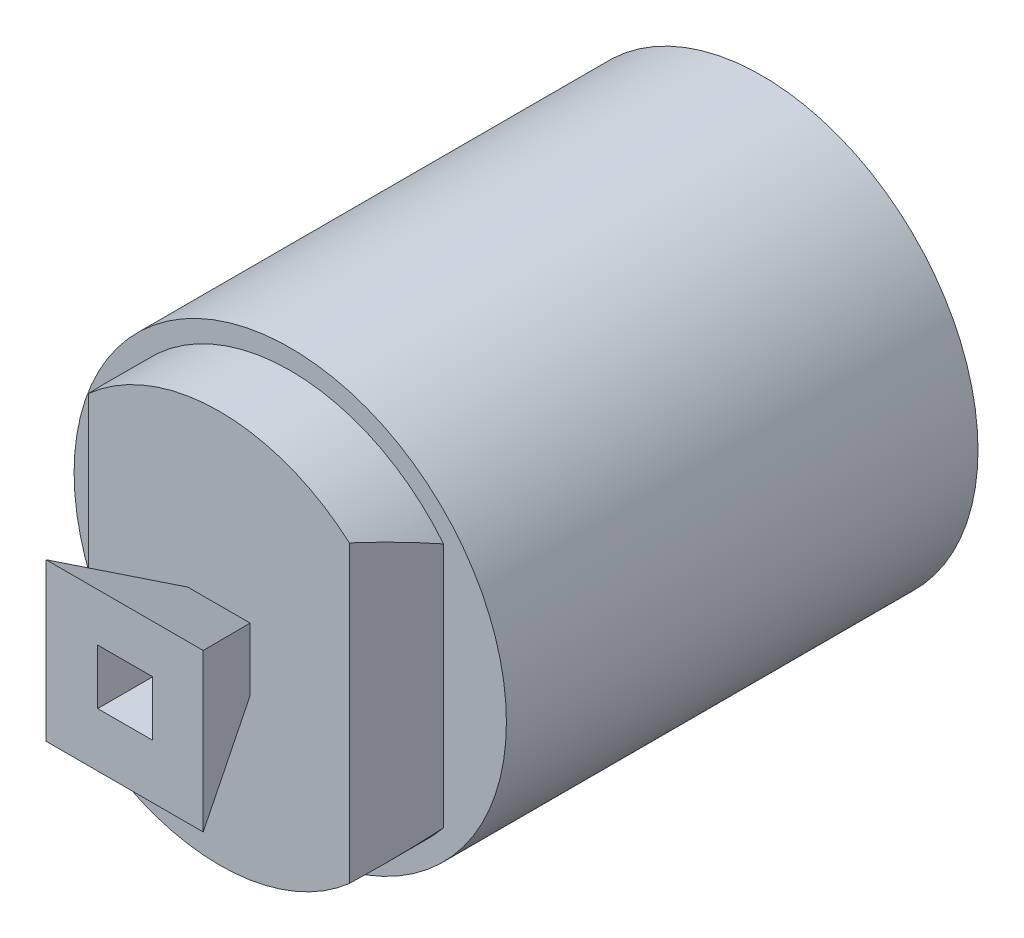
ISO-10303-21;
HEADER;
FILE_DESCRIPTION(('STEP AP214'),'2;1');
FILE_NAME('part.step','',(''),(''),'','','');
FILE_SCHEMA(('AUTOMOTIVE_DESIGN { 1 0 10303 214 1 1 1 1 }'));
ENDSEC;
DATA;
#1=APPLICATION_CONTEXT('core data for automotive mechanical design processes');
#2=APPLICATION_PROTOCOL_DEFINITION('international standard','automotive_design',2000,#1);
#3=PRODUCT_CONTEXT('',#1,'mechanical');
#4=PRODUCT('Part','Part','',(#3));
#5=PRODUCT_RELATED_PRODUCT_CATEGORY('part','',(#4));
#6=PRODUCT_DEFINITION_FORMATION('','',#4);
#7=PRODUCT_DEFINITION_CONTEXT('part definition',#1,'design');
#8=PRODUCT_DEFINITION('design','',#6,#7);
#9=PRODUCT_DEFINITION_SHAPE('','',#8);
#10=(LENGTH_UNIT() NAMED_UNIT(*) SI_UNIT(.MILLI.,.METRE.));
#11=(NAMED_UNIT(*) PLANE_ANGLE_UNIT() SI_UNIT($,.RADIAN.));
#12=(NAMED_UNIT(*) SI_UNIT($,.STERADIAN.) SOLID_ANGLE_UNIT());
#13=UNCERTAINTY_MEASURE_WITH_UNIT(LENGTH_MEASURE(1.E-05),#10,'distance_accuracy_value','');
#14=(GEOMETRIC_REPRESENTATION_CONTEXT(3) GLOBAL_UNCERTAINTY_ASSIGNED_CONTEXT((#13)) GLOBAL_UNIT_ASSIGNED_CONTEXT((#10,
#11,#12)) REPRESENTATION_CONTEXT('',''));
#15=CARTESIAN_POINT('',(0.,0.,0.));
#16=DIRECTION('',(0.,0.,1.));
#17=DIRECTION('',(1.,0.,0.));
#18=AXIS2_PLACEMENT_3D('',#15,#16,#17);
#19=CARTESIAN_POINT('',(-10.0761007393835,-20.,81.));
#20=DIRECTION('',(0.,0.,1.));
#21=DIRECTION('',(1.,0.,0.));
#22=AXIS2_PLACEMENT_3D('',#19,#20,#21);
#23=PLANE('',#22);
#24=DIRECTION('',(0.,1.,0.));
#25=VECTOR('',#24,1.);
#26=CARTESIAN_POINT('',(-10.0761007393835,-20.,81.));
#27=LINE('',#26,#25);
#28=CARTESIAN_POINT('',(-10.0761007393835,-10.386236585579,81.));
#29=VERTEX_POINT('',#28);
#30=CARTESIAN_POINT('',(-10.0761007393835,9.613763414421,81.));
#31=VERTEX_POINT('',#30);
#32=EDGE_CURVE('E281',#29,#31,#27,.T.);
#33=ORIENTED_EDGE('',*,*,#32,.F.);
#34=DIRECTION('',(-1.,0.,0.));
#35=VECTOR('',#34,1.);
#36=CARTESIAN_POINT('',(30.,-10.386236585579,81.));
#37=LINE('',#36,#35);
#38=CARTESIAN_POINT('',(9.92389926061654,-10.386236585579,81.));
#39=VERTEX_POINT('',#38);
#40=EDGE_CURVE('E261',#39,#29,#37,.T.);
#41=ORIENTED_EDGE('',*,*,#40,.F.);
#42=DIRECTION('',(0.,1.,0.));
#43=VECTOR('',#42,1.);
#44=CARTESIAN_POINT('',(9.92389926061654,-20.,81.));
#45=LINE('',#44,#43);
#46=CARTESIAN_POINT('',(9.92389926061654,9.613763414421,81.));
#47=VERTEX_POINT('',#46);
#48=EDGE_CURVE('E277',#39,#47,#45,.T.);
#49=ORIENTED_EDGE('',*,*,#48,.T.);
#50=DIRECTION('',(-1.,0.,0.));
#51=VECTOR('',#50,1.);
#52=CARTESIAN_POINT('',(30.,9.613763414421,81.));
#53=LINE('',#52,#51);
#54=EDGE_CURVE('E264',#47,#31,#53,.T.);
#55=ORIENTED_EDGE('',*,*,#54,.T.);
#56=EDGE_LOOP('',(#33,#41,#49,#55));
#57=FACE_BOUND('',#56,.T.);
#58=DIRECTION('',(1.,0.,0.));
#59=VECTOR('',#58,1.);
#60=CARTESIAN_POINT('',(-10.0761007393835,3.5,81.));
#61=LINE('',#60,#59);
#62=CARTESIAN_POINT('',(-3.5,3.5,81.));
#63=VERTEX_POINT('',#62);
#64=CARTESIAN_POINT('',(3.5,3.5,81.));
#65=VERTEX_POINT('',#64);
#66=EDGE_CURVE('E196',#63,#65,#61,.T.);
#67=ORIENTED_EDGE('',*,*,#66,.T.);
#68=DIRECTION('',(0.,-1.,0.));
#69=VECTOR('',#68,1.);
#70=CARTESIAN_POINT('',(3.5,-20.,81.));
#71=LINE('',#70,#69);
#72=CARTESIAN_POINT('',(3.5,-3.5,81.));
#73=VERTEX_POINT('',#72);
#74=EDGE_CURVE('E191',#65,#73,#71,.T.);
#75=ORIENTED_EDGE('',*,*,#74,.T.);
#76=DIRECTION('',(-1.,0.,0.));
#77=VECTOR('',#76,1.);
#78=CARTESIAN_POINT('',(-10.0761007393835,-3.5,81.));
#79=LINE('',#78,#77);
#80=CARTESIAN_POINT('',(-3.5,-3.5,81.));
#81=VERTEX_POINT('',#80);
#82=EDGE_CURVE('E180',#73,#81,#79,.T.);
#83=ORIENTED_EDGE('',*,*,#82,.T.);
#84=DIRECTION('',(0.,1.,0.));
#85=VECTOR('',#84,1.);
#86=CARTESIAN_POINT('',(-3.5,-20.,81.));
#87=LINE('',#86,#85);
#88=EDGE_CURVE('E185',#81,#63,#87,.T.);
#89=ORIENTED_EDGE('',*,*,#88,.T.);
#90=EDGE_LOOP('',(#67,#75,#83,#89));
#91=FACE_BOUND('',#90,.T.);
#92=ADVANCED_FACE('F34',(#57,#91),#23,.T.);
#93=CARTESIAN_POINT('',(0.,0.,68.));
#94=DIRECTION('',(0.,0.,-1.));
#95=DIRECTION('',(-1.,0.,0.));
#96=AXIS2_PLACEMENT_3D('',#93,#94,#95);
#97=PLANE('',#96);
#98=DIRECTION('',(0.,-1.,0.));
#99=VECTOR('',#98,1.);
#100=CARTESIAN_POINT('',(-16.,18.,68.));
#101=LINE('',#100,#99);
#102=CARTESIAN_POINT('',(-16.,18.,68.));
#103=VERTEX_POINT('',#102);
#104=CARTESIAN_POINT('',(-16.,-18.,68.));
#105=VERTEX_POINT('',#104);
#106=EDGE_CURVE('E239',#103,#105,#101,.T.);
#107=ORIENTED_EDGE('',*,*,#106,.F.);
#108=DIRECTION('',(-1.,0.,0.));
#109=VECTOR('',#108,1.);
#110=CARTESIAN_POINT('',(16.,18.,68.));
#111=LINE('',#110,#109);
#112=CARTESIAN_POINT('',(16.,18.,68.));
#113=VERTEX_POINT('',#112);
#114=EDGE_CURVE('E246',#113,#103,#111,.T.);
#115=ORIENTED_EDGE('',*,*,#114,.F.);
#116=DIRECTION('',(0.,1.,0.));
#117=VECTOR('',#116,1.);
#118=CARTESIAN_POINT('',(16.,18.,68.));
#119=LINE('',#118,#117);
#120=CARTESIAN_POINT('',(16.,-18.,68.));
#121=VERTEX_POINT('',#120);
#122=EDGE_CURVE('E244',#121,#113,#119,.T.);
#123=ORIENTED_EDGE('',*,*,#122,.F.);
#124=DIRECTION('',(1.,0.,0.));
#125=VECTOR('',#124,1.);
#126=CARTESIAN_POINT('',(16.,-18.,68.));
#127=LINE('',#126,#125);
#128=EDGE_CURVE('E242',#105,#121,#127,.T.);
#129=ORIENTED_EDGE('',*,*,#128,.F.);
#130=EDGE_LOOP('',(#107,#115,#123,#129));
#131=FACE_BOUND('',#130,.T.);
#132=DIRECTION('',(1.,0.,0.));
#133=VECTOR('',#132,1.);
#134=CARTESIAN_POINT('',(0.,-3.5,68.));
#135=LINE('',#134,#133);
#136=CARTESIAN_POINT('',(-3.5,-3.5,68.));
#137=VERTEX_POINT('',#136);
#138=CARTESIAN_POINT('',(3.5,-3.5,68.));
#139=VERTEX_POINT('',#138);
#140=EDGE_CURVE('E340',#137,#139,#135,.T.);
#141=ORIENTED_EDGE('',*,*,#140,.T.);
#142=DIRECTION('',(0.,1.,0.));
#143=VECTOR('',#142,1.);
#144=CARTESIAN_POINT('',(3.5,0.,68.));
#145=LINE('',#144,#143);
#146=CARTESIAN_POINT('',(3.5,3.5,68.));
#147=VERTEX_POINT('',#146);
#148=EDGE_CURVE('E11',#139,#147,#145,.T.);
#149=ORIENTED_EDGE('',*,*,#148,.T.);
#150=DIRECTION('',(-1.,0.,0.));
#151=VECTOR('',#150,1.);
#152=CARTESIAN_POINT('',(0.,3.5,68.));
#153=LINE('',#152,#151);
#154=CARTESIAN_POINT('',(-3.5,3.5,68.));
#155=VERTEX_POINT('',#154);
#156=EDGE_CURVE('E42',#147,#155,#153,.T.);
#157=ORIENTED_EDGE('',*,*,#156,.T.);
#158=DIRECTION('',(0.,-1.,0.));
#159=VECTOR('',#158,1.);
#160=CARTESIAN_POINT('',(-3.5,0.,68.));
#161=LINE('',#160,#159);
#162=EDGE_CURVE('E342',#155,#137,#161,.T.);
#163=ORIENTED_EDGE('',*,*,#162,.T.);
#164=EDGE_LOOP('',(#141,#149,#157,#163));
#165=FACE_BOUND('',#164,.T.);
#166=ADVANCED_FACE('F346',(#131,#165),#97,.T.);
#167=CARTESIAN_POINT('',(0.,0.,59.));
#168=DIRECTION('',(0.,0.,1.));
#169=DIRECTION('',(1.,0.,0.));
#170=AXIS2_PLACEMENT_3D('',#167,#168,#169);
#171=PLANE('',#170);
#172=CARTESIAN_POINT('',(0.,0.,59.));
#173=DIRECTION('',(0.,0.,1.));
#174=DIRECTION('',(1.,0.,0.));
#175=AXIS2_PLACEMENT_3D('',#172,#173,#174);
#176=CIRCLE('',#175,27.);
#177=CARTESIAN_POINT('',(27.,0.,59.));
#178=VERTEX_POINT('',#177);
#179=EDGE_CURVE('E306',#178,#178,#176,.T.);
#180=ORIENTED_EDGE('',*,*,#179,.F.);
#181=EDGE_LOOP('',(#180));
#182=FACE_BOUND('',#181,.T.);
#183=DIRECTION('',(1.,0.,0.));
#184=VECTOR('',#183,1.);
#185=CARTESIAN_POINT('',(0.,15.,59.));
#186=LINE('',#185,#184);
#187=CARTESIAN_POINT('',(-19.0078041691542,15.,59.));
#188=VERTEX_POINT('',#187);
#189=CARTESIAN_POINT('',(-16.,15.,59.));
#190=VERTEX_POINT('',#189);
#191=EDGE_CURVE('E226',#188,#190,#186,.T.);
#192=ORIENTED_EDGE('',*,*,#191,.F.);
#193=DIRECTION('',(0.,1.,0.));
#194=VECTOR('',#193,1.);
#195=CARTESIAN_POINT('',(-19.0078041691542,0.,59.));
#196=LINE('',#195,#194);
#197=CARTESIAN_POINT('',(-19.0078041691542,-15.,59.));
#198=VERTEX_POINT('',#197);
#199=EDGE_CURVE('E232',#198,#188,#196,.T.);
#200=ORIENTED_EDGE('',*,*,#199,.F.);
#201=DIRECTION('',(1.,0.,0.));
#202=VECTOR('',#201,1.);
#203=CARTESIAN_POINT('',(0.,-15.,59.));
#204=LINE('',#203,#202);
#205=CARTESIAN_POINT('',(-16.,-15.,59.));
#206=VERTEX_POINT('',#205);
#207=EDGE_CURVE('E218',#198,#206,#204,.T.);
#208=ORIENTED_EDGE('',*,*,#207,.T.);
#209=DIRECTION('',(0.,1.,0.));
#210=VECTOR('',#209,1.);
#211=CARTESIAN_POINT('',(-16.,0.,59.));
#212=LINE('',#211,#210);
#213=CARTESIAN_POINT('',(-16.,-18.,59.));
#214=VERTEX_POINT('',#213);
#215=EDGE_CURVE('E337',#214,#206,#212,.T.);
#216=ORIENTED_EDGE('',*,*,#215,.F.);
#217=DIRECTION('',(-1.,0.,0.));
#218=VECTOR('',#217,1.);
#219=CARTESIAN_POINT('',(0.,-18.,59.));
#220=LINE('',#219,#218);
#221=CARTESIAN_POINT('',(16.,-18.,59.));
#222=VERTEX_POINT('',#221);
#223=EDGE_CURVE('E334',#222,#214,#220,.T.);
#224=ORIENTED_EDGE('',*,*,#223,.F.);
#225=DIRECTION('',(0.,-1.,0.));
#226=VECTOR('',#225,1.);
#227=CARTESIAN_POINT('',(16.,0.,59.));
#228=LINE('',#227,#226);
#229=CARTESIAN_POINT('',(16.,-15.,59.));
#230=VERTEX_POINT('',#229);
#231=EDGE_CURVE('E330',#230,#222,#228,.T.);
#232=ORIENTED_EDGE('',*,*,#231,.F.);
#233=CARTESIAN_POINT('',(18.8315879003216,-15.,59.));
#234=VERTEX_POINT('',#233);
#235=EDGE_CURVE('E214',#230,#234,#204,.T.);
#236=ORIENTED_EDGE('',*,*,#235,.T.);
#237=DIRECTION('',(0.,-1.,0.));
#238=VECTOR('',#237,1.);
#239=CARTESIAN_POINT('',(18.8315879003216,0.,59.));
#240=LINE('',#239,#238);
#241=CARTESIAN_POINT('',(18.8315879003216,15.,59.));
#242=VERTEX_POINT('',#241);
#243=EDGE_CURVE('E237',#242,#234,#240,.T.);
#244=ORIENTED_EDGE('',*,*,#243,.F.);
#245=CARTESIAN_POINT('',(16.,15.,59.));
#246=VERTEX_POINT('',#245);
#247=EDGE_CURVE('E223',#246,#242,#186,.T.);
#248=ORIENTED_EDGE('',*,*,#247,.F.);
#249=CARTESIAN_POINT('',(16.,18.,59.));
#250=VERTEX_POINT('',#249);
#251=EDGE_CURVE('E331',#250,#246,#228,.T.);
#252=ORIENTED_EDGE('',*,*,#251,.F.);
#253=DIRECTION('',(1.,0.,0.));
#254=VECTOR('',#253,1.);
#255=CARTESIAN_POINT('',(0.,18.,59.));
#256=LINE('',#255,#254);
#257=CARTESIAN_POINT('',(-16.,18.,59.));
#258=VERTEX_POINT('',#257);
#259=EDGE_CURVE('E328',#258,#250,#256,.T.);
#260=ORIENTED_EDGE('',*,*,#259,.F.);
#261=EDGE_CURVE('E336',#190,#258,#212,.T.);
#262=ORIENTED_EDGE('',*,*,#261,.F.);
#263=EDGE_LOOP('',(#192,#200,#208,#216,#224,#232,#236,#244,#248,#252,#260,#262));
#264=FACE_BOUND('',#263,.T.);
#265=ADVANCED_FACE('F372',(#182,#264),#171,.F.);
#266=CARTESIAN_POINT('',(-16.,18.,68.));
#267=DIRECTION('',(1.,0.,0.));
#268=DIRECTION('',(0.,1.,0.));
#269=AXIS2_PLACEMENT_3D('',#266,#267,#268);
#270=PLANE('',#269);
#271=DIRECTION('',(0.,1.,0.));
#272=VECTOR('',#271,1.);
#273=CARTESIAN_POINT('',(-16.,18.,67.8492471136705));
#274=LINE('',#273,#272);
#275=CARTESIAN_POINT('',(-16.,-15.,67.8492471136705));
#276=VERTEX_POINT('',#275);
#277=CARTESIAN_POINT('',(-16.,15.,67.8492471136705));
#278=VERTEX_POINT('',#277);
#279=EDGE_CURVE('E229',#276,#278,#274,.T.);
#280=ORIENTED_EDGE('',*,*,#279,.T.);
#281=DIRECTION('',(0.,0.,-1.));
#282=VECTOR('',#281,1.);
#283=CARTESIAN_POINT('',(-16.,15.,68.));
#284=LINE('',#283,#282);
#285=EDGE_CURVE('E225',#278,#190,#284,.T.);
#286=ORIENTED_EDGE('',*,*,#285,.T.);
#287=ORIENTED_EDGE('',*,*,#261,.T.);
#288=DIRECTION('',(0.,0.,-1.));
#289=VECTOR('',#288,1.);
#290=CARTESIAN_POINT('',(-16.,18.,68.));
#291=LINE('',#290,#289);
#292=EDGE_CURVE('E248',#103,#258,#291,.T.);
#293=ORIENTED_EDGE('',*,*,#292,.F.);
#294=ORIENTED_EDGE('',*,*,#106,.T.);
#295=DIRECTION('',(0.,0.,-1.));
#296=VECTOR('',#295,1.);
#297=CARTESIAN_POINT('',(-16.,-18.,68.));
#298=LINE('',#297,#296);
#299=EDGE_CURVE('E257',#105,#214,#298,.T.);
#300=ORIENTED_EDGE('',*,*,#299,.T.);
#301=ORIENTED_EDGE('',*,*,#215,.T.);
#302=DIRECTION('',(0.,0.,-1.));
#303=VECTOR('',#302,1.);
#304=CARTESIAN_POINT('',(-16.,-15.,68.));
#305=LINE('',#304,#303);
#306=EDGE_CURVE('E217',#276,#206,#305,.T.);
#307=ORIENTED_EDGE('',*,*,#306,.F.);
#308=EDGE_LOOP('',(#280,#286,#287,#293,#294,#300,#301,#307));
#309=FACE_BOUND('',#308,.T.);
#310=ADVANCED_FACE('F409',(#309),#270,.T.);
#311=CARTESIAN_POINT('',(16.,18.,68.));
#312=DIRECTION('',(-1.,0.,0.));
#313=DIRECTION('',(0.,-1.,0.));
#314=AXIS2_PLACEMENT_3D('',#311,#312,#313);
#315=PLANE('',#314);
#316=ORIENTED_EDGE('',*,*,#251,.T.);
#317=DIRECTION('',(0.,0.,1.));
#318=VECTOR('',#317,1.);
#319=CARTESIAN_POINT('',(16.,15.,68.));
#320=LINE('',#319,#318);
#321=CARTESIAN_POINT('',(16.,15.,67.5394789664373));
#322=VERTEX_POINT('',#321);
#323=EDGE_CURVE('E220',#246,#322,#320,.T.);
#324=ORIENTED_EDGE('',*,*,#323,.T.);
#325=DIRECTION('',(0.,-1.,0.));
#326=VECTOR('',#325,1.);
#327=CARTESIAN_POINT('',(16.,18.,67.5394789664373));
#328=LINE('',#327,#326);
#329=CARTESIAN_POINT('',(16.,-15.,67.5394789664373));
#330=VERTEX_POINT('',#329);
#331=EDGE_CURVE('E234',#322,#330,#328,.T.);
#332=ORIENTED_EDGE('',*,*,#331,.T.);
#333=DIRECTION('',(0.,0.,1.));
#334=VECTOR('',#333,1.);
#335=CARTESIAN_POINT('',(16.,-15.,68.));
#336=LINE('',#335,#334);
#337=EDGE_CURVE('E212',#230,#330,#336,.T.);
#338=ORIENTED_EDGE('',*,*,#337,.F.);
#339=ORIENTED_EDGE('',*,*,#231,.T.);
#340=DIRECTION('',(0.,0.,-1.));
#341=VECTOR('',#340,1.);
#342=CARTESIAN_POINT('',(16.,-18.,68.));
#343=LINE('',#342,#341);
#344=EDGE_CURVE('E254',#121,#222,#343,.T.);
#345=ORIENTED_EDGE('',*,*,#344,.F.);
#346=ORIENTED_EDGE('',*,*,#122,.T.);
#347=DIRECTION('',(0.,0.,-1.));
#348=VECTOR('',#347,1.);
#349=CARTESIAN_POINT('',(16.,18.,68.));
#350=LINE('',#349,#348);
#351=EDGE_CURVE('E251',#113,#250,#350,.T.);
#352=ORIENTED_EDGE('',*,*,#351,.T.);
#353=EDGE_LOOP('',(#316,#324,#332,#338,#339,#345,#346,#352));
#354=FACE_BOUND('',#353,.T.);
#355=ADVANCED_FACE('F388',(#354),#315,.T.);
#356=CARTESIAN_POINT('',(9.92389926061654,-20.,81.));
#357=DIRECTION('',(0.893452439046446,0.,-0.44915781097734));
#358=DIRECTION('',(-0.44915781097734,0.,-0.893452439046446));
#359=AXIS2_PLACEMENT_3D('',#356,#357,#358);
#360=PLANE('',#359);
#361=ORIENTED_EDGE('',*,*,#48,.F.);
#362=DIRECTION('',(-0.410097562207873,0.407877429988755,-0.815754859977511));
#363=VECTOR('',#362,1.);
#364=CARTESIAN_POINT('',(11.5319890419045,-11.9856207020114,84.1987682328648));
#365=LINE('',#364,#363);
#366=CARTESIAN_POINT('',(3.89124044614115,-4.386236585579,69.));
#367=VERTEX_POINT('',#366);
#368=EDGE_CURVE('E273',#39,#367,#365,.T.);
#369=ORIENTED_EDGE('',*,*,#368,.T.);
#370=DIRECTION('',(0.,1.,0.));
#371=VECTOR('',#370,1.);
#372=CARTESIAN_POINT('',(3.89124044614115,-20.,69.));
#373=LINE('',#372,#371);
#374=CARTESIAN_POINT('',(3.89124044614115,3.613763414421,69.));
#375=VERTEX_POINT('',#374);
#376=EDGE_CURVE('E276',#367,#375,#373,.T.);
#377=ORIENTED_EDGE('',*,*,#376,.T.);
#378=DIRECTION('',(0.410097562207873,0.407877429988755,0.815754859977511));
#379=VECTOR('',#378,1.);
#380=CARTESIAN_POINT('',(4.97041868496857,4.68709934010398,71.146671851366));
#381=LINE('',#380,#379);
#382=EDGE_CURVE('E267',#375,#47,#381,.T.);
#383=ORIENTED_EDGE('',*,*,#382,.T.);
#384=EDGE_LOOP('',(#361,#369,#377,#383));
#385=FACE_BOUND('',#384,.T.);
#386=ADVANCED_FACE('F384',(#385),#360,.T.);
#387=CARTESIAN_POINT('',(-10.0761007393835,-20.,81.));
#388=DIRECTION('',(-0.893452439046446,0.,-0.44915781097734));
#389=DIRECTION('',(-0.44915781097734,0.,0.893452439046446));
#390=AXIS2_PLACEMENT_3D('',#387,#388,#389);
#391=PLANE('',#390);
#392=DIRECTION('',(0.,1.,0.));
#393=VECTOR('',#392,1.);
#394=CARTESIAN_POINT('',(-4.04344192490807,-20.,69.));
#395=LINE('',#394,#393);
#396=CARTESIAN_POINT('',(-4.04344192490807,-4.386236585579,69.));
#397=VERTEX_POINT('',#396);
#398=CARTESIAN_POINT('',(-4.04344192490807,3.613763414421,69.));
#399=VERTEX_POINT('',#398);
#400=EDGE_CURVE('E284',#397,#399,#395,.T.);
#401=ORIENTED_EDGE('',*,*,#400,.F.);
#402=DIRECTION('',(-0.410097562207872,-0.407877429988755,0.815754859977511));
#403=VECTOR('',#402,1.);
#404=CARTESIAN_POINT('',(-11.6841905206714,-11.9856207020114,84.1987682328648));
#405=LINE('',#404,#403);
#406=EDGE_CURVE('E325',#397,#29,#405,.T.);
#407=ORIENTED_EDGE('',*,*,#406,.T.);
#408=ORIENTED_EDGE('',*,*,#32,.T.);
#409=DIRECTION('',(0.410097562207872,-0.407877429988755,-0.815754859977511));
#410=VECTOR('',#409,1.);
#411=CARTESIAN_POINT('',(-5.12262016373549,4.68709934010398,71.146671851366));
#412=LINE('',#411,#410);
#413=EDGE_CURVE('E322',#31,#399,#412,.T.);
#414=ORIENTED_EDGE('',*,*,#413,.T.);
#415=EDGE_LOOP('',(#401,#407,#408,#414));
#416=FACE_BOUND('',#415,.T.);
#417=ADVANCED_FACE('F380',(#416),#391,.T.);
#418=CARTESIAN_POINT('',(0.,0.,69.));
#419=DIRECTION('',(0.,0.,1.));
#420=DIRECTION('',(1.,0.,0.));
#421=AXIS2_PLACEMENT_3D('',#418,#419,#420);
#422=PLANE('',#421);
#423=DIRECTION('',(-1.,0.,0.));
#424=VECTOR('',#423,1.);
#425=CARTESIAN_POINT('',(30.,-4.386236585579,69.));
#426=LINE('',#425,#424);
#427=EDGE_CURVE('E263',#367,#397,#426,.T.);
#428=ORIENTED_EDGE('',*,*,#427,.T.);
#429=ORIENTED_EDGE('',*,*,#400,.T.);
#430=DIRECTION('',(-1.,0.,0.));
#431=VECTOR('',#430,1.);
#432=CARTESIAN_POINT('',(30.,3.613763414421,69.));
#433=LINE('',#432,#431);
#434=EDGE_CURVE('E260',#375,#399,#433,.T.);
#435=ORIENTED_EDGE('',*,*,#434,.F.);
#436=ORIENTED_EDGE('',*,*,#376,.F.);
#437=EDGE_LOOP('',(#428,#429,#435,#436));
#438=FACE_BOUND('',#437,.T.);
#439=DIRECTION('',(0.,-1.,0.));
#440=VECTOR('',#439,1.);
#441=CARTESIAN_POINT('',(-16.6679103758723,0.,69.));
#442=LINE('',#441,#440);
#443=CARTESIAN_POINT('',(-16.6679103758723,18.632787330453,69.));
#444=VERTEX_POINT('',#443);
#445=CARTESIAN_POINT('',(-16.6679103758723,-18.632787330453,69.));
#446=VERTEX_POINT('',#445);
#447=EDGE_CURVE('E320',#444,#446,#442,.T.);
#448=ORIENTED_EDGE('',*,*,#447,.T.);
#449=CARTESIAN_POINT('',(0.,0.,69.));
#450=DIRECTION('',(0.,0.,1.));
#451=DIRECTION('',(1.,0.,0.));
#452=AXIS2_PLACEMENT_3D('',#449,#450,#451);
#453=CIRCLE('',#452,25.);
#454=CARTESIAN_POINT('',(16.5157088971054,-18.7678277812344,69.));
#455=VERTEX_POINT('',#454);
#456=EDGE_CURVE('E302',#446,#455,#453,.T.);
#457=ORIENTED_EDGE('',*,*,#456,.T.);
#458=DIRECTION('',(0.,1.,0.));
#459=VECTOR('',#458,1.);
#460=CARTESIAN_POINT('',(16.5157088971054,0.,69.));
#461=LINE('',#460,#459);
#462=CARTESIAN_POINT('',(16.5157088971054,18.7678277812344,69.));
#463=VERTEX_POINT('',#462);
#464=EDGE_CURVE('E313',#455,#463,#461,.T.);
#465=ORIENTED_EDGE('',*,*,#464,.T.);
#466=EDGE_CURVE('E299',#463,#444,#453,.T.);
#467=ORIENTED_EDGE('',*,*,#466,.T.);
#468=EDGE_LOOP('',(#448,#457,#465,#467));
#469=FACE_BOUND('',#468,.T.);
#470=ADVANCED_FACE('F383',(#438,#469),#422,.T.);
#471=CARTESIAN_POINT('',(0.,0.,69.));
#472=DIRECTION('',(0.,0.,-1.));
#473=DIRECTION('',(-1.,0.,0.));
#474=AXIS2_PLACEMENT_3D('',#471,#472,#473);
#475=CYLINDRICAL_SURFACE('',#474,25.);
#476=CARTESIAN_POINT('',(0.,0.,119.003731127617));
#477=DIRECTION('',(-0.948683298050514,0.,0.316227766016838));
#478=DIRECTION('',(-0.316227766016838,0.,-0.948683298050514));
#479=AXIS2_PLACEMENT_3D('',#476,#477,#478);
#480=ELLIPSE('',#479,79.0569415042095,25.);
#481=CARTESIAN_POINT('',(-19.6679103758723,-15.4328643305983,60.));
#482=VERTEX_POINT('',#481);
#483=EDGE_CURVE('E298',#482,#446,#480,.T.);
#484=ORIENTED_EDGE('',*,*,#483,.F.);
#485=CARTESIAN_POINT('',(0.,0.,60.));
#486=DIRECTION('',(0.,0.,1.));
#487=DIRECTION('',(1.,0.,0.));
#488=AXIS2_PLACEMENT_3D('',#485,#486,#487);
#489=CIRCLE('',#488,25.);
#490=CARTESIAN_POINT('',(19.5,-15.644487847162,60.));
#491=VERTEX_POINT('',#490);
#492=EDGE_CURVE('E303',#491,#482,#489,.F.);
#493=ORIENTED_EDGE('',*,*,#492,.F.);
#494=CARTESIAN_POINT('',(0.,0.,118.807935938211));
#495=DIRECTION('',(0.949179144879652,0.,0.314736319679717));
#496=DIRECTION('',(0.314736319679717,0.,-0.949179144879652));
#497=AXIS2_PLACEMENT_3D('',#494,#495,#496);
#498=ELLIPSE('',#497,79.4315699740041,25.);
#499=EDGE_CURVE('E291',#455,#491,#498,.T.);
#500=ORIENTED_EDGE('',*,*,#499,.F.);
#501=ORIENTED_EDGE('',*,*,#456,.F.);
#502=EDGE_LOOP('',(#484,#493,#500,#501));
#503=FACE_BOUND('',#502,.T.);
#504=ADVANCED_FACE('F401',(#503),#475,.T.);
#505=CARTESIAN_POINT('',(-19.6679103758723,15.4328643305983,60.));
#506=VERTEX_POINT('',#505);
#507=EDGE_CURVE('E296',#444,#506,#480,.T.);
#508=ORIENTED_EDGE('',*,*,#507,.F.);
#509=ORIENTED_EDGE('',*,*,#466,.F.);
#510=CARTESIAN_POINT('',(19.5,15.644487847162,60.));
#511=VERTEX_POINT('',#510);
#512=EDGE_CURVE('E295',#511,#463,#498,.T.);
#513=ORIENTED_EDGE('',*,*,#512,.F.);
#514=EDGE_CURVE('E301',#506,#511,#489,.F.);
#515=ORIENTED_EDGE('',*,*,#514,.F.);
#516=EDGE_LOOP('',(#508,#509,#513,#515));
#517=FACE_BOUND('',#516,.T.);
#518=ADVANCED_FACE('F405',(#517),#475,.T.);
#519=CARTESIAN_POINT('',(0.,0.,60.));
#520=DIRECTION('',(0.,0.,-1.));
#521=DIRECTION('',(-1.,0.,0.));
#522=AXIS2_PLACEMENT_3D('',#519,#520,#521);
#523=CYLINDRICAL_SURFACE('',#522,27.5);
#524=CARTESIAN_POINT('',(0.,0.,60.));
#525=DIRECTION('',(0.,0.,1.));
#526=DIRECTION('',(1.,0.,0.));
#527=AXIS2_PLACEMENT_3D('',#524,#525,#526);
#528=CIRCLE('',#527,27.5);
#529=CARTESIAN_POINT('',(27.5,0.,60.));
#530=VERTEX_POINT('',#529);
#531=EDGE_CURVE('E310',#530,#530,#528,.T.);
#532=ORIENTED_EDGE('',*,*,#531,.F.);
#533=EDGE_LOOP('',(#532));
#534=FACE_BOUND('',#533,.T.);
#535=CARTESIAN_POINT('',(0.,0.,0.));
#536=DIRECTION('',(0.,0.,1.));
#537=DIRECTION('',(1.,0.,0.));
#538=AXIS2_PLACEMENT_3D('',#535,#536,#537);
#539=CIRCLE('',#538,27.5);
#540=CARTESIAN_POINT('',(27.5,0.,0.));
#541=VERTEX_POINT('',#540);
#542=EDGE_CURVE('E314',#541,#541,#539,.T.);
#543=ORIENTED_EDGE('',*,*,#542,.T.);
#544=EDGE_LOOP('',(#543));
#545=FACE_BOUND('',#544,.T.);
#546=ADVANCED_FACE('F36',(#534,#545),#523,.T.);
#547=CARTESIAN_POINT('',(0.,0.,60.));
#548=DIRECTION('',(0.,0.,1.));
#549=DIRECTION('',(1.,0.,0.));
#550=AXIS2_PLACEMENT_3D('',#547,#548,#549);
#551=PLANE('',#550);
#552=DIRECTION('',(0.,-1.,0.));
#553=VECTOR('',#552,1.);
#554=CARTESIAN_POINT('',(-19.6679103758723,43.,60.));
#555=LINE('',#554,#553);
#556=EDGE_CURVE('E289',#506,#482,#555,.T.);
#557=ORIENTED_EDGE('',*,*,#556,.F.);
#558=ORIENTED_EDGE('',*,*,#514,.T.);
#559=DIRECTION('',(0.,-1.,0.));
#560=VECTOR('',#559,1.);
#561=CARTESIAN_POINT('',(19.5,43.,60.));
#562=LINE('',#561,#560);
#563=EDGE_CURVE('E280',#511,#491,#562,.T.);
#564=ORIENTED_EDGE('',*,*,#563,.T.);
#565=ORIENTED_EDGE('',*,*,#492,.T.);
#566=EDGE_LOOP('',(#557,#558,#564,#565));
#567=FACE_BOUND('',#566,.T.);
#568=ORIENTED_EDGE('',*,*,#531,.T.);
#569=EDGE_LOOP('',(#568));
#570=FACE_BOUND('',#569,.T.);
#571=ADVANCED_FACE('F415',(#567,#570),#551,.T.);
#572=CARTESIAN_POINT('',(0.,0.,0.));
#573=DIRECTION('',(0.,0.,1.));
#574=DIRECTION('',(1.,0.,0.));
#575=AXIS2_PLACEMENT_3D('',#572,#573,#574);
#576=PLANE('',#575);
#577=CARTESIAN_POINT('',(0.,0.,0.));
#578=DIRECTION('',(0.,0.,1.));
#579=DIRECTION('',(1.,0.,0.));
#580=AXIS2_PLACEMENT_3D('',#577,#578,#579);
#581=CIRCLE('',#580,27.);
#582=CARTESIAN_POINT('',(27.,0.,0.));
#583=VERTEX_POINT('',#582);
#584=EDGE_CURVE('E309',#583,#583,#581,.T.);
#585=ORIENTED_EDGE('',*,*,#584,.T.);
#586=EDGE_LOOP('',(#585));
#587=FACE_BOUND('',#586,.T.);
#588=ORIENTED_EDGE('',*,*,#542,.F.);
#589=EDGE_LOOP('',(#588));
#590=FACE_BOUND('',#589,.T.);
#591=ADVANCED_FACE('F413',(#587,#590),#576,.F.);
#592=CARTESIAN_POINT('',(0.,0.,-2.));
#593=DIRECTION('',(0.,0.,1.));
#594=DIRECTION('',(1.,0.,0.));
#595=AXIS2_PLACEMENT_3D('',#592,#593,#594);
#596=CYLINDRICAL_SURFACE('',#595,27.);
#597=ORIENTED_EDGE('',*,*,#179,.T.);
#598=EDGE_LOOP('',(#597));
#599=FACE_BOUND('',#598,.T.);
#600=ORIENTED_EDGE('',*,*,#584,.F.);
#601=EDGE_LOOP('',(#600));
#602=FACE_BOUND('',#601,.T.);
#603=ADVANCED_FACE('F397',(#599,#602),#596,.F.);
#604=CARTESIAN_POINT('',(16.5157088971054,43.,69.));
#605=DIRECTION('',(0.949179144879652,0.,0.314736319679717));
#606=DIRECTION('',(0.314736319679717,0.,-0.949179144879652));
#607=AXIS2_PLACEMENT_3D('',#604,#605,#606);
#608=PLANE('',#607);
#609=ORIENTED_EDGE('',*,*,#512,.T.);
#610=ORIENTED_EDGE('',*,*,#464,.F.);
#611=ORIENTED_EDGE('',*,*,#499,.T.);
#612=ORIENTED_EDGE('',*,*,#563,.F.);
#613=EDGE_LOOP('',(#609,#610,#611,#612));
#614=FACE_BOUND('',#613,.T.);
#615=ADVANCED_FACE('F393',(#614),#608,.T.);
#616=CARTESIAN_POINT('',(-16.6679103758723,43.,69.));
#617=DIRECTION('',(-0.948683298050514,0.,0.316227766016838));
#618=DIRECTION('',(0.316227766016838,0.,0.948683298050514));
#619=AXIS2_PLACEMENT_3D('',#616,#617,#618);
#620=PLANE('',#619);
#621=ORIENTED_EDGE('',*,*,#483,.T.);
#622=ORIENTED_EDGE('',*,*,#447,.F.);
#623=ORIENTED_EDGE('',*,*,#507,.T.);
#624=ORIENTED_EDGE('',*,*,#556,.T.);
#625=EDGE_LOOP('',(#621,#622,#623,#624));
#626=FACE_BOUND('',#625,.T.);
#627=ADVANCED_FACE('F390',(#626),#620,.T.);
#628=CARTESIAN_POINT('',(30.,3.613763414421,69.));
#629=DIRECTION('',(0.,0.894427190999916,-0.447213595499958));
#630=DIRECTION('',(0.,0.447213595499958,0.894427190999916));
#631=AXIS2_PLACEMENT_3D('',#628,#629,#630);
#632=PLANE('',#631);
#633=ORIENTED_EDGE('',*,*,#434,.T.);
#634=ORIENTED_EDGE('',*,*,#413,.F.);
#635=ORIENTED_EDGE('',*,*,#54,.F.);
#636=ORIENTED_EDGE('',*,*,#382,.F.);
#637=EDGE_LOOP('',(#633,#634,#635,#636));
#638=FACE_BOUND('',#637,.T.);
#639=ADVANCED_FACE('F378',(#638),#632,.T.);
#640=CARTESIAN_POINT('',(30.,-10.386236585579,81.));
#641=DIRECTION('',(0.,-0.894427190999916,-0.447213595499958));
#642=DIRECTION('',(0.,0.447213595499958,-0.894427190999916));
#643=AXIS2_PLACEMENT_3D('',#640,#641,#642);
#644=PLANE('',#643);
#645=ORIENTED_EDGE('',*,*,#40,.T.);
#646=ORIENTED_EDGE('',*,*,#406,.F.);
#647=ORIENTED_EDGE('',*,*,#427,.F.);
#648=ORIENTED_EDGE('',*,*,#368,.F.);
#649=EDGE_LOOP('',(#645,#646,#647,#648));
#650=FACE_BOUND('',#649,.T.);
#651=ADVANCED_FACE('F469',(#650),#644,.T.);
#652=CARTESIAN_POINT('',(16.,-18.,68.));
#653=DIRECTION('',(0.,1.,0.));
#654=DIRECTION('',(-1.,0.,0.));
#655=AXIS2_PLACEMENT_3D('',#652,#653,#654);
#656=PLANE('',#655);
#657=ORIENTED_EDGE('',*,*,#223,.T.);
#658=ORIENTED_EDGE('',*,*,#299,.F.);
#659=ORIENTED_EDGE('',*,*,#128,.T.);
#660=ORIENTED_EDGE('',*,*,#344,.T.);
#661=EDGE_LOOP('',(#657,#658,#659,#660));
#662=FACE_BOUND('',#661,.T.);
#663=ADVANCED_FACE('F479',(#662),#656,.T.);
#664=CARTESIAN_POINT('',(16.,18.,68.));
#665=DIRECTION('',(0.,-1.,0.));
#666=DIRECTION('',(1.,0.,0.));
#667=AXIS2_PLACEMENT_3D('',#664,#665,#666);
#668=PLANE('',#667);
#669=ORIENTED_EDGE('',*,*,#259,.T.);
#670=ORIENTED_EDGE('',*,*,#351,.F.);
#671=ORIENTED_EDGE('',*,*,#114,.T.);
#672=ORIENTED_EDGE('',*,*,#292,.T.);
#673=EDGE_LOOP('',(#669,#670,#671,#672));
#674=FACE_BOUND('',#673,.T.);
#675=ADVANCED_FACE('F488',(#674),#668,.T.);
#676=CARTESIAN_POINT('',(0.,-15.,0.));
#677=DIRECTION('',(0.,-1.,0.));
#678=DIRECTION('',(0.,0.,-1.));
#679=AXIS2_PLACEMENT_3D('',#676,#677,#678);
#680=PLANE('',#679);
#681=ORIENTED_EDGE('',*,*,#337,.T.);
#682=DIRECTION('',(0.314736319679717,0.,-0.949179144879652));
#683=VECTOR('',#682,1.);
#684=CARTESIAN_POINT('',(18.8919962603116,-15.,58.8178209761834));
#685=LINE('',#684,#683);
#686=EDGE_CURVE('E197',#330,#234,#685,.T.);
#687=ORIENTED_EDGE('',*,*,#686,.T.);
#688=ORIENTED_EDGE('',*,*,#235,.F.);
#689=EDGE_LOOP('',(#681,#687,#688));
#690=FACE_BOUND('',#689,.T.);
#691=ADVANCED_FACE('F499',(#690),#680,.F.);
#692=CARTESIAN_POINT('',(0.,15.,0.));
#693=DIRECTION('',(0.,-1.,0.));
#694=DIRECTION('',(0.,0.,-1.));
#695=AXIS2_PLACEMENT_3D('',#692,#693,#694);
#696=PLANE('',#695);
#697=ORIENTED_EDGE('',*,*,#247,.T.);
#698=DIRECTION('',(0.314736319679717,0.,-0.949179144879652));
#699=VECTOR('',#698,1.);
#700=CARTESIAN_POINT('',(18.8919962603116,15.,58.8178209761834));
#701=LINE('',#700,#699);
#702=EDGE_CURVE('E206',#322,#242,#701,.T.);
#703=ORIENTED_EDGE('',*,*,#702,.F.);
#704=ORIENTED_EDGE('',*,*,#323,.F.);
#705=EDGE_LOOP('',(#697,#703,#704));
#706=FACE_BOUND('',#705,.T.);
#707=ADVANCED_FACE('F533',(#706),#696,.T.);
#708=CARTESIAN_POINT('',(18.8919962603116,15.,58.8178209761834));
#709=DIRECTION('',(-0.949179144879652,0.,-0.314736319679717));
#710=DIRECTION('',(-0.314736319679717,0.,0.949179144879652));
#711=AXIS2_PLACEMENT_3D('',#708,#709,#710);
#712=PLANE('',#711);
#713=ORIENTED_EDGE('',*,*,#243,.T.);
#714=ORIENTED_EDGE('',*,*,#686,.F.);
#715=ORIENTED_EDGE('',*,*,#331,.F.);
#716=ORIENTED_EDGE('',*,*,#702,.T.);
#717=EDGE_LOOP('',(#713,#714,#715,#716));
#718=FACE_BOUND('',#717,.T.);
#719=ADVANCED_FACE('F544',(#718),#712,.T.);
#720=CARTESIAN_POINT('',(-19.0697256886156,15.,58.8178209761834));
#721=DIRECTION('',(0.946803387122169,0.,-0.321812594741083));
#722=DIRECTION('',(-0.321812594741083,0.,-0.946803387122169));
#723=AXIS2_PLACEMENT_3D('',#720,#721,#722);
#724=PLANE('',#723);
#725=ORIENTED_EDGE('',*,*,#199,.T.);
#726=DIRECTION('',(0.321812594741083,0.,0.946803387122169));
#727=VECTOR('',#726,1.);
#728=CARTESIAN_POINT('',(-19.0697256886156,15.,58.8178209761834));
#729=LINE('',#728,#727);
#730=EDGE_CURVE('E209',#188,#278,#729,.T.);
#731=ORIENTED_EDGE('',*,*,#730,.T.);
#732=ORIENTED_EDGE('',*,*,#279,.F.);
#733=DIRECTION('',(0.321812594741083,0.,0.946803387122169));
#734=VECTOR('',#733,1.);
#735=CARTESIAN_POINT('',(-19.0697256886156,-15.,58.8178209761834));
#736=LINE('',#735,#734);
#737=EDGE_CURVE('E200',#198,#276,#736,.T.);
#738=ORIENTED_EDGE('',*,*,#737,.F.);
#739=EDGE_LOOP('',(#725,#731,#732,#738));
#740=FACE_BOUND('',#739,.T.);
#741=ADVANCED_FACE('F555',(#740),#724,.T.);
#742=ORIENTED_EDGE('',*,*,#191,.T.);
#743=ORIENTED_EDGE('',*,*,#285,.F.);
#744=ORIENTED_EDGE('',*,*,#730,.F.);
#745=EDGE_LOOP('',(#742,#743,#744));
#746=FACE_BOUND('',#745,.T.);
#747=ADVANCED_FACE('F547',(#746),#696,.T.);
#748=ORIENTED_EDGE('',*,*,#737,.T.);
#749=ORIENTED_EDGE('',*,*,#306,.T.);
#750=ORIENTED_EDGE('',*,*,#207,.F.);
#751=EDGE_LOOP('',(#748,#749,#750));
#752=FACE_BOUND('',#751,.T.);
#753=ADVANCED_FACE('F536',(#752),#680,.F.);
#754=CARTESIAN_POINT('',(3.5,3.5,83.));
#755=DIRECTION('',(-1.,0.,0.));
#756=DIRECTION('',(0.,-1.,0.));
#757=AXIS2_PLACEMENT_3D('',#754,#755,#756);
#758=PLANE('',#757);
#759=DIRECTION('',(0.,0.,-1.));
#760=VECTOR('',#759,1.);
#761=CARTESIAN_POINT('',(3.5,3.5,83.));
#762=LINE('',#761,#760);
#763=EDGE_CURVE('E186',#65,#147,#762,.T.);
#764=ORIENTED_EDGE('',*,*,#763,.T.);
#765=ORIENTED_EDGE('',*,*,#148,.F.);
#766=DIRECTION('',(0.,0.,-1.));
#767=VECTOR('',#766,1.);
#768=CARTESIAN_POINT('',(3.5,-3.5,83.));
#769=LINE('',#768,#767);
#770=EDGE_CURVE('E54',#73,#139,#769,.T.);
#771=ORIENTED_EDGE('',*,*,#770,.F.);
#772=ORIENTED_EDGE('',*,*,#74,.F.);
#773=EDGE_LOOP('',(#764,#765,#771,#772));
#774=FACE_BOUND('',#773,.T.);
#775=ADVANCED_FACE('F190',(#774),#758,.T.);
#776=CARTESIAN_POINT('',(-3.5,3.5,83.));
#777=DIRECTION('',(0.,-1.,0.));
#778=DIRECTION('',(0.,0.,-1.));
#779=AXIS2_PLACEMENT_3D('',#776,#777,#778);
#780=PLANE('',#779);
#781=DIRECTION('',(0.,0.,-1.));
#782=VECTOR('',#781,1.);
#783=CARTESIAN_POINT('',(-3.5,3.5,83.));
#784=LINE('',#783,#782);
#785=EDGE_CURVE('E351',#63,#155,#784,.T.);
#786=ORIENTED_EDGE('',*,*,#785,.T.);
#787=ORIENTED_EDGE('',*,*,#156,.F.);
#788=ORIENTED_EDGE('',*,*,#763,.F.);
#789=ORIENTED_EDGE('',*,*,#66,.F.);
#790=EDGE_LOOP('',(#786,#787,#788,#789));
#791=FACE_BOUND('',#790,.T.);
#792=ADVANCED_FACE('F349',(#791),#780,.T.);
#793=CARTESIAN_POINT('',(-3.5,3.5,83.));
#794=DIRECTION('',(1.,0.,0.));
#795=DIRECTION('',(0.,1.,0.));
#796=AXIS2_PLACEMENT_3D('',#793,#794,#795);
#797=PLANE('',#796);
#798=DIRECTION('',(0.,0.,-1.));
#799=VECTOR('',#798,1.);
#800=CARTESIAN_POINT('',(-3.5,-3.5,83.));
#801=LINE('',#800,#799);
#802=EDGE_CURVE('E49',#81,#137,#801,.T.);
#803=ORIENTED_EDGE('',*,*,#802,.T.);
#804=ORIENTED_EDGE('',*,*,#162,.F.);
#805=ORIENTED_EDGE('',*,*,#785,.F.);
#806=ORIENTED_EDGE('',*,*,#88,.F.);
#807=EDGE_LOOP('',(#803,#804,#805,#806));
#808=FACE_BOUND('',#807,.T.);
#809=ADVANCED_FACE('F356',(#808),#797,.T.);
#810=CARTESIAN_POINT('',(-3.5,-3.5,83.));
#811=DIRECTION('',(0.,1.,0.));
#812=DIRECTION('',(0.,0.,1.));
#813=AXIS2_PLACEMENT_3D('',#810,#811,#812);
#814=PLANE('',#813);
#815=ORIENTED_EDGE('',*,*,#770,.T.);
#816=ORIENTED_EDGE('',*,*,#140,.F.);
#817=ORIENTED_EDGE('',*,*,#802,.F.);
#818=ORIENTED_EDGE('',*,*,#82,.F.);
#819=EDGE_LOOP('',(#815,#816,#817,#818));
#820=FACE_BOUND('',#819,.T.);
#821=ADVANCED_FACE('F181',(#820),#814,.T.);
#822=CLOSED_SHELL('',(#92,#166,#265,#310,#355,#386,#417,#470,#504,#518,#546,#571,#591,#603,#615,
#627,#639,#651,#663,#675,#691,#707,#719,#741,#747,#753,#775,#792,#809,#821));
#823=MANIFOLD_SOLID_BREP('B2',#822);
#824=ADVANCED_BREP_SHAPE_REPRESENTATION('',(#18,#823),#14);
#825=SHAPE_DEFINITION_REPRESENTATION(#9,#824);
ENDSEC;
END-ISO-10303-21;
